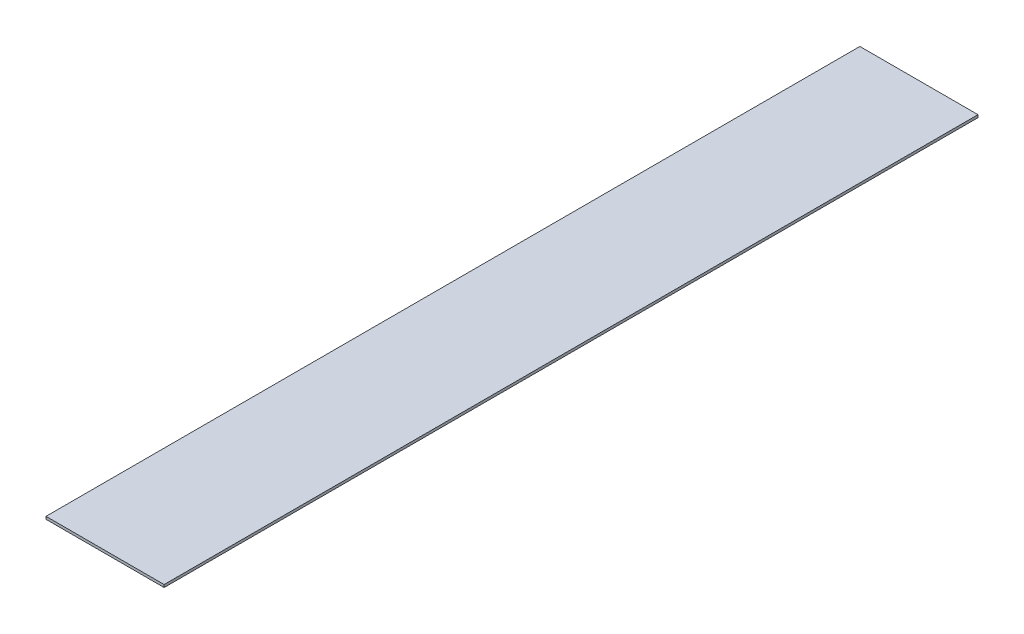
ISO-10303-21;
HEADER;
FILE_DESCRIPTION(('STEP AP214'),'2;1');
FILE_NAME('part.step','',(''),(''),'','','');
FILE_SCHEMA(('AUTOMOTIVE_DESIGN { 1 0 10303 214 1 1 1 1 }'));
ENDSEC;
DATA;
#1=APPLICATION_CONTEXT('core data for automotive mechanical design processes');
#2=APPLICATION_PROTOCOL_DEFINITION('international standard','automotive_design',2000,#1);
#3=PRODUCT_CONTEXT('',#1,'mechanical');
#4=PRODUCT('Part','Part','',(#3));
#5=PRODUCT_RELATED_PRODUCT_CATEGORY('part','',(#4));
#6=PRODUCT_DEFINITION_FORMATION('','',#4);
#7=PRODUCT_DEFINITION_CONTEXT('part definition',#1,'design');
#8=PRODUCT_DEFINITION('design','',#6,#7);
#9=PRODUCT_DEFINITION_SHAPE('','',#8);
#10=(LENGTH_UNIT() NAMED_UNIT(*) SI_UNIT(.MILLI.,.METRE.));
#11=(NAMED_UNIT(*) PLANE_ANGLE_UNIT() SI_UNIT($,.RADIAN.));
#12=(NAMED_UNIT(*) SI_UNIT($,.STERADIAN.) SOLID_ANGLE_UNIT());
#13=UNCERTAINTY_MEASURE_WITH_UNIT(LENGTH_MEASURE(1.E-05),#10,'distance_accuracy_value','');
#14=(GEOMETRIC_REPRESENTATION_CONTEXT(3) GLOBAL_UNCERTAINTY_ASSIGNED_CONTEXT((#13)) GLOBAL_UNIT_ASSIGNED_CONTEXT((#10,
#11,#12)) REPRESENTATION_CONTEXT('',''));
#15=CARTESIAN_POINT('',(0.,0.,0.));
#16=DIRECTION('',(0.,0.,1.));
#17=DIRECTION('',(1.,0.,0.));
#18=AXIS2_PLACEMENT_3D('',#15,#16,#17);
#19=CARTESIAN_POINT('',(45.,2.,-310.));
#20=DIRECTION('',(-1.,0.,0.));
#21=DIRECTION('',(0.,0.,1.));
#22=AXIS2_PLACEMENT_3D('',#19,#20,#21);
#23=PLANE('',#22);
#24=DIRECTION('',(0.,0.,-1.));
#25=VECTOR('',#24,1.);
#26=CARTESIAN_POINT('',(45.,0.,-310.));
#27=LINE('',#26,#25);
#28=CARTESIAN_POINT('',(45.0000000000001,0.,310.));
#29=VERTEX_POINT('',#28);
#30=CARTESIAN_POINT('',(45.,0.,-310.));
#31=VERTEX_POINT('',#30);
#32=EDGE_CURVE('E128',#29,#31,#27,.T.);
#33=ORIENTED_EDGE('',*,*,#32,.T.);
#34=DIRECTION('',(0.,-1.,0.));
#35=VECTOR('',#34,1.);
#36=CARTESIAN_POINT('',(45.,2.,-310.));
#37=LINE('',#36,#35);
#38=CARTESIAN_POINT('',(45.,2.,-310.));
#39=VERTEX_POINT('',#38);
#40=EDGE_CURVE('E12',#39,#31,#37,.T.);
#41=ORIENTED_EDGE('',*,*,#40,.F.);
#42=DIRECTION('',(0.,0.,-1.));
#43=VECTOR('',#42,1.);
#44=CARTESIAN_POINT('',(45.,2.,-310.));
#45=LINE('',#44,#43);
#46=CARTESIAN_POINT('',(45.0000000000001,2.,310.));
#47=VERTEX_POINT('',#46);
#48=EDGE_CURVE('E92',#47,#39,#45,.T.);
#49=ORIENTED_EDGE('',*,*,#48,.F.);
#50=DIRECTION('',(0.,-1.,0.));
#51=VECTOR('',#50,1.);
#52=CARTESIAN_POINT('',(45.0000000000001,2.,310.));
#53=LINE('',#52,#51);
#54=EDGE_CURVE('E104',#47,#29,#53,.T.);
#55=ORIENTED_EDGE('',*,*,#54,.T.);
#56=EDGE_LOOP('',(#33,#41,#49,#55));
#57=FACE_BOUND('',#56,.T.);
#58=ADVANCED_FACE('F40',(#57),#23,.F.);
#59=CARTESIAN_POINT('',(-45.,2.,-310.));
#60=DIRECTION('',(0.,0.,1.));
#61=DIRECTION('',(1.,0.,0.));
#62=AXIS2_PLACEMENT_3D('',#59,#60,#61);
#63=PLANE('',#62);
#64=DIRECTION('',(-1.,0.,0.));
#65=VECTOR('',#64,1.);
#66=CARTESIAN_POINT('',(-45.,0.,-310.));
#67=LINE('',#66,#65);
#68=CARTESIAN_POINT('',(-45.,0.,-310.));
#69=VERTEX_POINT('',#68);
#70=EDGE_CURVE('E97',#31,#69,#67,.T.);
#71=ORIENTED_EDGE('',*,*,#70,.T.);
#72=DIRECTION('',(0.,-1.,0.));
#73=VECTOR('',#72,1.);
#74=CARTESIAN_POINT('',(-45.,2.,-310.));
#75=LINE('',#74,#73);
#76=CARTESIAN_POINT('',(-45.,2.,-310.));
#77=VERTEX_POINT('',#76);
#78=EDGE_CURVE('E49',#77,#69,#75,.T.);
#79=ORIENTED_EDGE('',*,*,#78,.F.);
#80=DIRECTION('',(-1.,0.,0.));
#81=VECTOR('',#80,1.);
#82=CARTESIAN_POINT('',(-45.,2.,-310.));
#83=LINE('',#82,#81);
#84=EDGE_CURVE('E87',#39,#77,#83,.T.);
#85=ORIENTED_EDGE('',*,*,#84,.F.);
#86=ORIENTED_EDGE('',*,*,#40,.T.);
#87=EDGE_LOOP('',(#71,#79,#85,#86));
#88=FACE_BOUND('',#87,.T.);
#89=ADVANCED_FACE('F96',(#88),#63,.F.);
#90=CARTESIAN_POINT('',(-45.,2.,-310.));
#91=DIRECTION('',(1.,0.,0.));
#92=DIRECTION('',(0.,0.,-1.));
#93=AXIS2_PLACEMENT_3D('',#90,#91,#92);
#94=PLANE('',#93);
#95=DIRECTION('',(0.,0.,1.));
#96=VECTOR('',#95,1.);
#97=CARTESIAN_POINT('',(-45.,0.,-310.));
#98=LINE('',#97,#96);
#99=CARTESIAN_POINT('',(-45.,0.,310.));
#100=VERTEX_POINT('',#99);
#101=EDGE_CURVE('E74',#69,#100,#98,.T.);
#102=ORIENTED_EDGE('',*,*,#101,.T.);
#103=DIRECTION('',(0.,-1.,0.));
#104=VECTOR('',#103,1.);
#105=CARTESIAN_POINT('',(-45.,2.,310.));
#106=LINE('',#105,#104);
#107=CARTESIAN_POINT('',(-45.,2.,310.));
#108=VERTEX_POINT('',#107);
#109=EDGE_CURVE('E99',#108,#100,#106,.T.);
#110=ORIENTED_EDGE('',*,*,#109,.F.);
#111=DIRECTION('',(0.,0.,1.));
#112=VECTOR('',#111,1.);
#113=CARTESIAN_POINT('',(-45.,2.,-310.));
#114=LINE('',#113,#112);
#115=EDGE_CURVE('E90',#77,#108,#114,.T.);
#116=ORIENTED_EDGE('',*,*,#115,.F.);
#117=ORIENTED_EDGE('',*,*,#78,.T.);
#118=EDGE_LOOP('',(#102,#110,#116,#117));
#119=FACE_BOUND('',#118,.T.);
#120=ADVANCED_FACE('F100',(#119),#94,.F.);
#121=CARTESIAN_POINT('',(-45.,2.,310.));
#122=DIRECTION('',(0.,0.,-1.));
#123=DIRECTION('',(-1.,0.,0.));
#124=AXIS2_PLACEMENT_3D('',#121,#122,#123);
#125=PLANE('',#124);
#126=DIRECTION('',(1.,0.,0.));
#127=VECTOR('',#126,1.);
#128=CARTESIAN_POINT('',(-45.,0.,310.));
#129=LINE('',#128,#127);
#130=EDGE_CURVE('E80',#100,#29,#129,.T.);
#131=ORIENTED_EDGE('',*,*,#130,.T.);
#132=ORIENTED_EDGE('',*,*,#54,.F.);
#133=DIRECTION('',(1.,0.,0.));
#134=VECTOR('',#133,1.);
#135=CARTESIAN_POINT('',(-45.,2.,310.));
#136=LINE('',#135,#134);
#137=EDGE_CURVE('E57',#108,#47,#136,.T.);
#138=ORIENTED_EDGE('',*,*,#137,.F.);
#139=ORIENTED_EDGE('',*,*,#109,.T.);
#140=EDGE_LOOP('',(#131,#132,#138,#139));
#141=FACE_BOUND('',#140,.T.);
#142=ADVANCED_FACE('F123',(#141),#125,.F.);
#143=CARTESIAN_POINT('',(0.,2.,0.));
#144=DIRECTION('',(0.,1.,0.));
#145=DIRECTION('',(0.,0.,1.));
#146=AXIS2_PLACEMENT_3D('',#143,#144,#145);
#147=PLANE('',#146);
#148=ORIENTED_EDGE('',*,*,#48,.T.);
#149=ORIENTED_EDGE('',*,*,#84,.T.);
#150=ORIENTED_EDGE('',*,*,#115,.T.);
#151=ORIENTED_EDGE('',*,*,#137,.T.);
#152=EDGE_LOOP('',(#148,#149,#150,#151));
#153=FACE_BOUND('',#152,.T.);
#154=ADVANCED_FACE('F88',(#153),#147,.T.);
#155=CARTESIAN_POINT('',(0.,0.,0.));
#156=DIRECTION('',(0.,1.,0.));
#157=DIRECTION('',(0.,0.,1.));
#158=AXIS2_PLACEMENT_3D('',#155,#156,#157);
#159=PLANE('',#158);
#160=ORIENTED_EDGE('',*,*,#32,.F.);
#161=ORIENTED_EDGE('',*,*,#130,.F.);
#162=ORIENTED_EDGE('',*,*,#101,.F.);
#163=ORIENTED_EDGE('',*,*,#70,.F.);
#164=EDGE_LOOP('',(#160,#161,#162,#163));
#165=FACE_BOUND('',#164,.T.);
#166=ADVANCED_FACE('F126',(#165),#159,.F.);
#167=CLOSED_SHELL('',(#58,#89,#120,#142,#154,#166));
#168=MANIFOLD_SOLID_BREP('B2',#167);
#169=ADVANCED_BREP_SHAPE_REPRESENTATION('',(#18,#168),#14);
#170=SHAPE_DEFINITION_REPRESENTATION(#9,#169);
ENDSEC;
END-ISO-10303-21;
